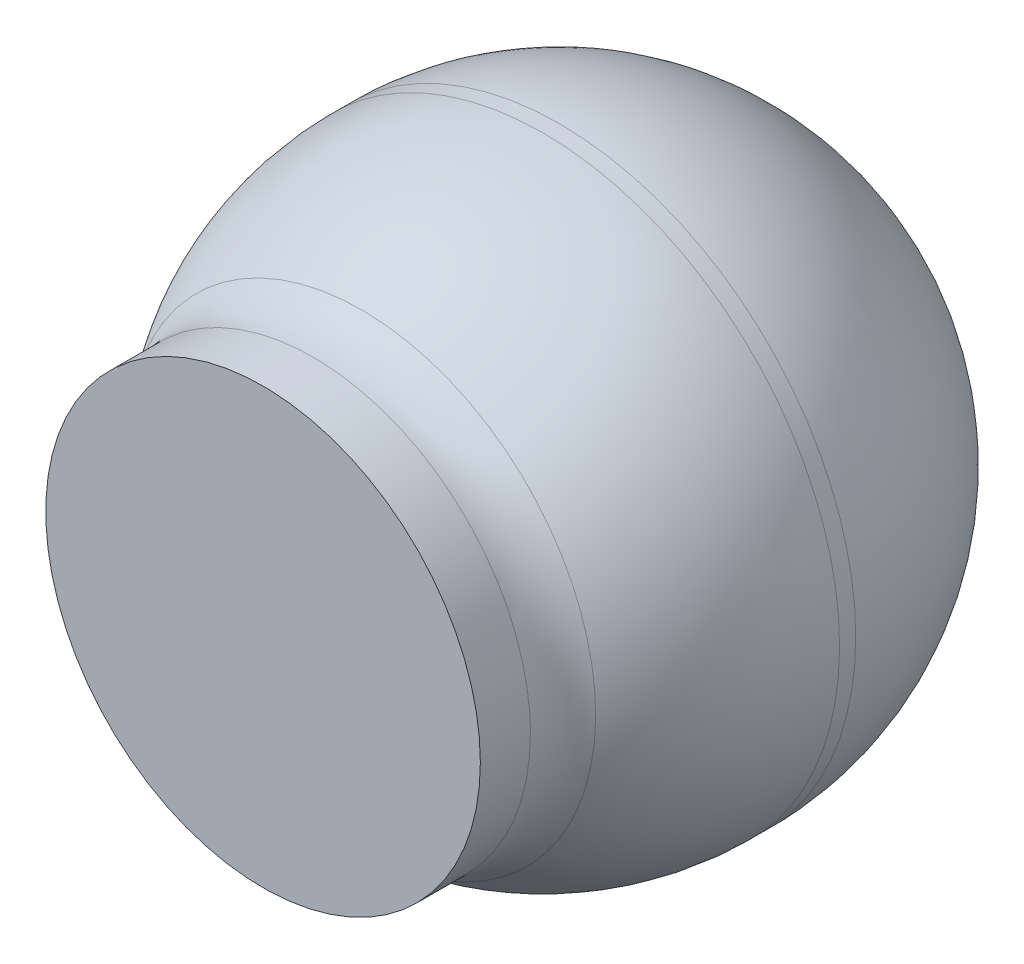
ISO-10303-21;
HEADER;
FILE_DESCRIPTION(('STEP AP214'),'2;1');
FILE_NAME('part.step','',(''),(''),'','','');
FILE_SCHEMA(('AUTOMOTIVE_DESIGN { 1 0 10303 214 1 1 1 1 }'));
ENDSEC;
DATA;
#1=APPLICATION_CONTEXT('core data for automotive mechanical design processes');
#2=APPLICATION_PROTOCOL_DEFINITION('international standard','automotive_design',2000,#1);
#3=PRODUCT_CONTEXT('',#1,'mechanical');
#4=PRODUCT('Part','Part','',(#3));
#5=PRODUCT_RELATED_PRODUCT_CATEGORY('part','',(#4));
#6=PRODUCT_DEFINITION_FORMATION('','',#4);
#7=PRODUCT_DEFINITION_CONTEXT('part definition',#1,'design');
#8=PRODUCT_DEFINITION('design','',#6,#7);
#9=PRODUCT_DEFINITION_SHAPE('','',#8);
#10=(LENGTH_UNIT() NAMED_UNIT(*) SI_UNIT(.MILLI.,.METRE.));
#11=(NAMED_UNIT(*) PLANE_ANGLE_UNIT() SI_UNIT($,.RADIAN.));
#12=(NAMED_UNIT(*) SI_UNIT($,.STERADIAN.) SOLID_ANGLE_UNIT());
#13=UNCERTAINTY_MEASURE_WITH_UNIT(LENGTH_MEASURE(1.E-05),#10,'distance_accuracy_value','');
#14=(GEOMETRIC_REPRESENTATION_CONTEXT(3) GLOBAL_UNCERTAINTY_ASSIGNED_CONTEXT((#13)) GLOBAL_UNIT_ASSIGNED_CONTEXT((#10,
#11,#12)) REPRESENTATION_CONTEXT('',''));
#15=CARTESIAN_POINT('',(0.,0.,0.));
#16=DIRECTION('',(0.,0.,1.));
#17=DIRECTION('',(1.,0.,0.));
#18=AXIS2_PLACEMENT_3D('',#15,#16,#17);
#19=CARTESIAN_POINT('',(-4.372919922269,-10.40134929145,10.006534503384));
#20=DIRECTION('',(0.,0.,-1.));
#21=DIRECTION('',(-1.,0.,0.));
#22=AXIS2_PLACEMENT_3D('',#19,#20,#21);
#23=PLANE('',#22);
#24=CARTESIAN_POINT('',(-4.372919922269,-10.40134929145,10.006534503384));
#25=DIRECTION('',(0.,0.,1.));
#26=DIRECTION('',(1.,0.,0.));
#27=AXIS2_PLACEMENT_3D('',#24,#25,#26);
#28=CIRCLE('',#27,0.275);
#29=CARTESIAN_POINT('',(-4.097919922269,-10.40134929145,10.006534503384));
#30=VERTEX_POINT('',#29);
#31=EDGE_CURVE('E20',#30,#30,#28,.F.);
#32=ORIENTED_EDGE('',*,*,#31,.F.);
#33=EDGE_LOOP('',(#32));
#34=FACE_BOUND('',#33,.T.);
#35=ADVANCED_FACE('F17',(#34),#23,.F.);
#36=CARTESIAN_POINT('',(-4.372919922269,-10.40134929145,9.906534503384));
#37=DIRECTION('',(0.,0.,1.));
#38=DIRECTION('',(1.,0.,0.));
#39=AXIS2_PLACEMENT_3D('',#36,#37,#38);
#40=CYLINDRICAL_SURFACE('',#39,0.275);
#41=CARTESIAN_POINT('',(-4.372919922269,-10.40134929145,9.943180457728));
#42=DIRECTION('',(0.,0.,-1.));
#43=DIRECTION('',(0.996700902337582,0.081162252799247,0.));
#44=AXIS2_PLACEMENT_3D('',#41,#42,#43);
#45=CIRCLE('',#44,0.275);
#46=CARTESIAN_POINT('',(-4.09882717412617,-10.3790296719302,9.943180457728));
#47=VERTEX_POINT('',#46);
#48=EDGE_CURVE('E66',#47,#47,#45,.F.);
#49=ORIENTED_EDGE('',*,*,#48,.T.);
#50=EDGE_LOOP('',(#49));
#51=FACE_BOUND('',#50,.T.);
#52=ORIENTED_EDGE('',*,*,#31,.T.);
#53=EDGE_LOOP('',(#52));
#54=FACE_BOUND('',#53,.T.);
#55=ADVANCED_FACE('F62',(#51,#54),#40,.T.);
#56=CARTESIAN_POINT('',(-4.372919922269,-10.40134929145,9.943180457728));
#57=DIRECTION('',(0.,0.,-1.));
#58=DIRECTION('',(0.996700902337583,0.0811622527992448,0.));
#59=AXIS2_PLACEMENT_3D('',#56,#57,#58);
#60=TOROIDAL_SURFACE('',#59,0.375,0.1);
#61=ORIENTED_EDGE('',*,*,#48,.F.);
#62=EDGE_LOOP('',(#61));
#63=FACE_BOUND('',#62,.T.);
#64=CARTESIAN_POINT('',(-4.372919922269,-10.40134929145,9.881744931236));
#65=DIRECTION('',(0.,0.,-1.));
#66=DIRECTION('',(-0.99670090233869,-0.0811622527856412,0.));
#67=AXIS2_PLACEMENT_3D('',#64,#65,#66);
#68=CIRCLE('',#67,0.29609704641234);
#69=CARTESIAN_POINT('',(-4.668040115608,-10.42538119478,9.881744931236));
#70=VERTEX_POINT('',#69);
#71=EDGE_CURVE('E39',#70,#70,#68,.T.);
#72=ORIENTED_EDGE('',*,*,#71,.F.);
#73=EDGE_LOOP('',(#72));
#74=FACE_BOUND('',#73,.T.);
#75=ADVANCED_FACE('F57',(#63,#74),#60,.F.);
#76=CARTESIAN_POINT('',(-4.746682760645,-10.43178513625,9.651976062157));
#77=CARTESIAN_POINT('',(-4.746682760645,-10.43178513625,9.701461392103));
#78=CARTESIAN_POINT('',(-4.738526217348,-10.43112094157,9.750947004335));
#79=CARTESIAN_POINT('',(-4.722207085349,-10.42979205995,9.798626332798));
#80=CARTESIAN_POINT('',(-4.698341390838,-10.42784865493,9.842699544317));
#81=CARTESIAN_POINT('',(-4.668040115608,-10.42538119478,9.881744931236));
#82=(BOUNDED_CURVE() B_SPLINE_CURVE(5,(#76,#77,#78,#79,#80,#81),.UNSPECIFIED.,.F.,
.F.) B_SPLINE_CURVE_WITH_KNOTS((6,6),(0.,0.661568582165),
.UNSPECIFIED.) CURVE() GEOMETRIC_REPRESENTATION_ITEM() RATIONAL_B_SPLINE_CURVE((1.,1.,1.,1.,1.,1.)) REPRESENTATION_ITEM(''));
#83=CARTESIAN_POINT('',(-4.372919922269,-10.40134929145,9.651976062157));
#84=DIRECTION('',(0.,0.,-1.));
#85=AXIS1_PLACEMENT('',#83,#84);
#86=SURFACE_OF_REVOLUTION('',#82,#85);
#87=CARTESIAN_POINT('',(-4.372919922269,-10.40134929145,9.651976062157));
#88=DIRECTION('',(0.,0.,1.));
#89=DIRECTION('',(1.,0.,0.));
#90=AXIS2_PLACEMENT_3D('',#87,#88,#89);
#91=CIRCLE('',#90,0.375);
#92=CARTESIAN_POINT('',(-3.997919922269,-10.40134929145,9.651976062157));
#93=VERTEX_POINT('',#92);
#94=EDGE_CURVE('E36',#93,#93,#91,.F.);
#95=ORIENTED_EDGE('',*,*,#94,.F.);
#96=EDGE_LOOP('',(#95));
#97=FACE_BOUND('',#96,.T.);
#98=ORIENTED_EDGE('',*,*,#71,.T.);
#99=EDGE_LOOP('',(#98));
#100=FACE_BOUND('',#99,.T.);
#101=ADVANCED_FACE('F53',(#97,#100),#86,.F.);
#102=CARTESIAN_POINT('',(-4.372919922269,-10.40134929145,9.256534503384));
#103=DIRECTION('',(0.,0.,1.));
#104=DIRECTION('',(1.,0.,0.));
#105=AXIS2_PLACEMENT_3D('',#102,#103,#104);
#106=CYLINDRICAL_SURFACE('',#105,0.375);
#107=CARTESIAN_POINT('',(-4.372919922269,-10.40134929145,9.631534503384));
#108=DIRECTION('',(0.,0.,-1.));
#109=DIRECTION('',(0.0811622527992357,-0.996700902337583,0.));
#110=AXIS2_PLACEMENT_3D('',#107,#108,#109);
#111=CIRCLE('',#110,0.375);
#112=CARTESIAN_POINT('',(-4.34248407746929,-10.7751121298266,9.631534503384));
#113=VERTEX_POINT('',#112);
#114=CARTESIAN_POINT('',(-4.40335576706871,-10.0275864530734,9.631534503384));
#115=VERTEX_POINT('',#114);
#116=EDGE_CURVE('E11',#113,#115,#111,.T.);
#117=ORIENTED_EDGE('',*,*,#116,.F.);
#118=CARTESIAN_POINT('',(-4.372919922269,-10.40134929145,9.631534503384));
#119=DIRECTION('',(3.33436315446763E-12,2.72100352061447E-13,1.));
#120=DIRECTION('',(0.0811622527992365,-0.996700902337583,0.));
#121=AXIS2_PLACEMENT_3D('',#118,#119,#120);
#122=CIRCLE('',#121,0.375);
#123=EDGE_CURVE('E25',#115,#113,#122,.F.);
#124=ORIENTED_EDGE('',*,*,#123,.F.);
#125=EDGE_LOOP('',(#117,#124));
#126=FACE_BOUND('',#125,.T.);
#127=ORIENTED_EDGE('',*,*,#94,.T.);
#128=EDGE_LOOP('',(#127));
#129=FACE_BOUND('',#128,.T.);
#130=ADVANCED_FACE('F34',(#126,#129),#106,.T.);
#131=CARTESIAN_POINT('',(-4.372919922269,-10.40134929145,9.631534503384));
#132=DIRECTION('',(0.0811622527992361,-0.996700902337583,0.));
#133=DIRECTION('',(-0.996700902337583,-0.0811622527992361,0.));
#134=AXIS2_PLACEMENT_3D('',#131,#132,#133);
#135=SPHERICAL_SURFACE('',#134,0.375);
#136=ORIENTED_EDGE('',*,*,#123,.T.);
#137=ORIENTED_EDGE('',*,*,#116,.T.);
#138=EDGE_LOOP('',(#136,#137));
#139=FACE_BOUND('',#138,.T.);
#140=ADVANCED_FACE('F32',(#139),#135,.T.);
#141=CLOSED_SHELL('',(#35,#55,#75,#101,#130,#140));
#142=MANIFOLD_SOLID_BREP('B1',#141);
#143=ADVANCED_BREP_SHAPE_REPRESENTATION('',(#18,#142),#14);
#144=SHAPE_DEFINITION_REPRESENTATION(#9,#143);
ENDSEC;
END-ISO-10303-21;
